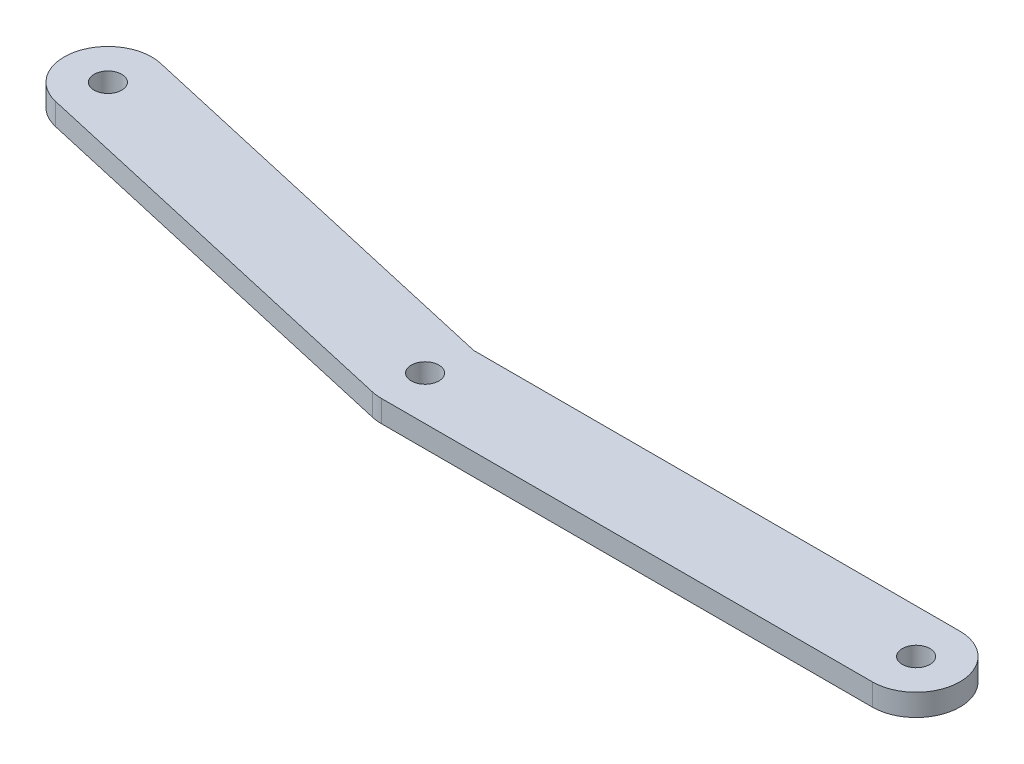
ISO-10303-21;
HEADER;
FILE_DESCRIPTION(('STEP AP214'),'2;1');
FILE_NAME('part.step','',(''),(''),'','','');
FILE_SCHEMA(('AUTOMOTIVE_DESIGN { 1 0 10303 214 1 1 1 1 }'));
ENDSEC;
DATA;
#1=APPLICATION_CONTEXT('core data for automotive mechanical design processes');
#2=APPLICATION_PROTOCOL_DEFINITION('international standard','automotive_design',2000,#1);
#3=PRODUCT_CONTEXT('',#1,'mechanical');
#4=PRODUCT('Part','Part','',(#3));
#5=PRODUCT_RELATED_PRODUCT_CATEGORY('part','',(#4));
#6=PRODUCT_DEFINITION_FORMATION('','',#4);
#7=PRODUCT_DEFINITION_CONTEXT('part definition',#1,'design');
#8=PRODUCT_DEFINITION('design','',#6,#7);
#9=PRODUCT_DEFINITION_SHAPE('','',#8);
#10=(LENGTH_UNIT() NAMED_UNIT(*) SI_UNIT(.MILLI.,.METRE.));
#11=(NAMED_UNIT(*) PLANE_ANGLE_UNIT() SI_UNIT($,.RADIAN.));
#12=(NAMED_UNIT(*) SI_UNIT($,.STERADIAN.) SOLID_ANGLE_UNIT());
#13=UNCERTAINTY_MEASURE_WITH_UNIT(LENGTH_MEASURE(1.E-05),#10,'distance_accuracy_value','');
#14=(GEOMETRIC_REPRESENTATION_CONTEXT(3) GLOBAL_UNCERTAINTY_ASSIGNED_CONTEXT((#13)) GLOBAL_UNIT_ASSIGNED_CONTEXT((#10,
#11,#12)) REPRESENTATION_CONTEXT('',''));
#15=CARTESIAN_POINT('',(0.,0.,0.));
#16=DIRECTION('',(0.,0.,1.));
#17=DIRECTION('',(1.,0.,0.));
#18=AXIS2_PLACEMENT_3D('',#15,#16,#17);
#19=CARTESIAN_POINT('',(-35.56,3.175,0.));
#20=DIRECTION('',(0.,-1.,0.));
#21=DIRECTION('',(0.,0.,-1.));
#22=AXIS2_PLACEMENT_3D('',#19,#20,#21);
#23=CYLINDRICAL_SURFACE('',#22,6.35);
#24=DIRECTION('',(0.,-1.,0.));
#25=VECTOR('',#24,1.);
#26=CARTESIAN_POINT('',(-35.56,3.175,6.35));
#27=LINE('',#26,#25);
#28=CARTESIAN_POINT('',(-35.56,3.175,6.35));
#29=VERTEX_POINT('',#28);
#30=CARTESIAN_POINT('',(-35.56,0.,6.35));
#31=VERTEX_POINT('',#30);
#32=EDGE_CURVE('E54',#29,#31,#27,.T.);
#33=ORIENTED_EDGE('',*,*,#32,.F.);
#34=CARTESIAN_POINT('',(-35.56,3.175,0.));
#35=DIRECTION('',(0.,1.,0.));
#36=DIRECTION('',(0.,0.,1.));
#37=AXIS2_PLACEMENT_3D('',#34,#35,#36);
#38=CIRCLE('',#37,6.35);
#39=CARTESIAN_POINT('',(-36.9668329598836,3.175,6.19219839984034));
#40=VERTEX_POINT('',#39);
#41=EDGE_CURVE('E118',#40,#29,#38,.T.);
#42=ORIENTED_EDGE('',*,*,#41,.F.);
#43=DIRECTION('',(0.,-1.,0.));
#44=VECTOR('',#43,1.);
#45=CARTESIAN_POINT('',(-36.9668329598836,3.175,6.19219839984034));
#46=LINE('',#45,#44);
#47=CARTESIAN_POINT('',(-36.9668329598836,0.,6.19219839984034));
#48=VERTEX_POINT('',#47);
#49=EDGE_CURVE('E143',#40,#48,#46,.T.);
#50=ORIENTED_EDGE('',*,*,#49,.T.);
#51=CARTESIAN_POINT('',(-35.56,0.,0.));
#52=DIRECTION('',(0.,1.,0.));
#53=DIRECTION('',(0.,0.,1.));
#54=AXIS2_PLACEMENT_3D('',#51,#52,#53);
#55=CIRCLE('',#54,6.35);
#56=EDGE_CURVE('E135',#48,#31,#55,.T.);
#57=ORIENTED_EDGE('',*,*,#56,.T.);
#58=EDGE_LOOP('',(#33,#42,#50,#57));
#59=FACE_BOUND('',#58,.T.);
#60=ADVANCED_FACE('F39',(#59),#23,.T.);
#61=CARTESIAN_POINT('',(-0.338584720633398,3.175,1.49028621385869));
#62=DIRECTION('',(-0.221548497619461,0.,0.975149354305565));
#63=DIRECTION('',(0.975149354305565,0.,0.221548497619461));
#64=AXIS2_PLACEMENT_3D('',#61,#62,#63);
#65=PLANE('',#64);
#66=DIRECTION('',(-0.975149354305565,0.,-0.221548497619461));
#67=VECTOR('',#66,1.);
#68=CARTESIAN_POINT('',(-0.338584720633398,3.175,1.49028621385869));
#69=LINE('',#68,#67);
#70=CARTESIAN_POINT('',(-34.8477333773181,3.175,-6.35));
#71=VERTEX_POINT('',#70);
#72=CARTESIAN_POINT('',(-93.5982716785836,3.175,-19.6977948147227));
#73=VERTEX_POINT('',#72);
#74=EDGE_CURVE('E62',#71,#73,#69,.T.);
#75=ORIENTED_EDGE('',*,*,#74,.F.);
#76=DIRECTION('',(0.,-1.,0.));
#77=VECTOR('',#76,1.);
#78=CARTESIAN_POINT('',(-34.8477333773181,3.175,-6.35));
#79=LINE('',#78,#77);
#80=CARTESIAN_POINT('',(-34.8477333773181,0.,-6.35));
#81=VERTEX_POINT('',#80);
#82=EDGE_CURVE('E125',#71,#81,#79,.T.);
#83=ORIENTED_EDGE('',*,*,#82,.T.);
#84=DIRECTION('',(-0.975149354305565,0.,-0.221548497619461));
#85=VECTOR('',#84,1.);
#86=CARTESIAN_POINT('',(-0.338584720633398,0.,1.49028621385869));
#87=LINE('',#86,#85);
#88=CARTESIAN_POINT('',(-93.5982716785836,0.,-19.6977948147227));
#89=VERTEX_POINT('',#88);
#90=EDGE_CURVE('E146',#81,#89,#87,.T.);
#91=ORIENTED_EDGE('',*,*,#90,.T.);
#92=DIRECTION('',(0.,-1.,0.));
#93=VECTOR('',#92,1.);
#94=CARTESIAN_POINT('',(-93.5982716785836,3.175,-19.6977948147227));
#95=LINE('',#94,#93);
#96=EDGE_CURVE('E11',#73,#89,#95,.T.);
#97=ORIENTED_EDGE('',*,*,#96,.F.);
#98=EDGE_LOOP('',(#75,#83,#91,#97));
#99=FACE_BOUND('',#98,.T.);
#100=ADVANCED_FACE('F200',(#99),#65,.F.);
#101=CARTESIAN_POINT('',(-95.0051046384672,3.175,-13.5055964148823));
#102=DIRECTION('',(0.,-1.,0.));
#103=DIRECTION('',(0.,0.,-1.));
#104=AXIS2_PLACEMENT_3D('',#101,#102,#103);
#105=CYLINDRICAL_SURFACE('',#104,6.35);
#106=CARTESIAN_POINT('',(-95.0051046384672,0.,-13.5055964148823));
#107=DIRECTION('',(0.,1.,0.));
#108=DIRECTION('',(0.,0.,1.));
#109=AXIS2_PLACEMENT_3D('',#106,#107,#108);
#110=CIRCLE('',#109,6.35);
#111=CARTESIAN_POINT('',(-96.4119375983508,0.,-7.313398015042));
#112=VERTEX_POINT('',#111);
#113=EDGE_CURVE('E148',#89,#112,#110,.T.);
#114=ORIENTED_EDGE('',*,*,#113,.T.);
#115=DIRECTION('',(0.,-1.,0.));
#116=VECTOR('',#115,1.);
#117=CARTESIAN_POINT('',(-96.4119375983508,3.175,-7.313398015042));
#118=LINE('',#117,#116);
#119=CARTESIAN_POINT('',(-96.4119375983508,3.175,-7.313398015042));
#120=VERTEX_POINT('',#119);
#121=EDGE_CURVE('E47',#120,#112,#118,.T.);
#122=ORIENTED_EDGE('',*,*,#121,.F.);
#123=CARTESIAN_POINT('',(-95.0051046384672,3.175,-13.5055964148823));
#124=DIRECTION('',(0.,1.,0.));
#125=DIRECTION('',(0.,0.,1.));
#126=AXIS2_PLACEMENT_3D('',#123,#124,#125);
#127=CIRCLE('',#126,6.35);
#128=EDGE_CURVE('E137',#73,#120,#127,.T.);
#129=ORIENTED_EDGE('',*,*,#128,.F.);
#130=ORIENTED_EDGE('',*,*,#96,.T.);
#131=EDGE_LOOP('',(#114,#122,#129,#130));
#132=FACE_BOUND('',#131,.T.);
#133=ADVANCED_FACE('F162',(#132),#105,.T.);
#134=CARTESIAN_POINT('',(-3.15225064040056,3.175,13.8746830135394));
#135=DIRECTION('',(-0.221548497619461,0.,0.975149354305565));
#136=DIRECTION('',(0.975149354305565,0.,0.221548497619461));
#137=AXIS2_PLACEMENT_3D('',#134,#135,#136);
#138=PLANE('',#137);
#139=DIRECTION('',(-0.975149354305565,0.,-0.221548497619461));
#140=VECTOR('',#139,1.);
#141=CARTESIAN_POINT('',(-3.15225064040056,0.,13.8746830135394));
#142=LINE('',#141,#140);
#143=EDGE_CURVE('E151',#48,#112,#142,.T.);
#144=ORIENTED_EDGE('',*,*,#143,.F.);
#145=ORIENTED_EDGE('',*,*,#49,.F.);
#146=DIRECTION('',(-0.975149354305565,0.,-0.221548497619461));
#147=VECTOR('',#146,1.);
#148=CARTESIAN_POINT('',(-3.15225064040056,3.175,13.8746830135394));
#149=LINE('',#148,#147);
#150=EDGE_CURVE('E139',#40,#120,#149,.T.);
#151=ORIENTED_EDGE('',*,*,#150,.T.);
#152=ORIENTED_EDGE('',*,*,#121,.T.);
#153=EDGE_LOOP('',(#144,#145,#151,#152));
#154=FACE_BOUND('',#153,.T.);
#155=ADVANCED_FACE('F158',(#154),#138,.T.);
#156=CARTESIAN_POINT('',(-95.0051046384672,3.175,-13.5055964148823));
#157=DIRECTION('',(0.,-1.,0.));
#158=DIRECTION('',(0.,0.,-1.));
#159=AXIS2_PLACEMENT_3D('',#156,#157,#158);
#160=CYLINDRICAL_SURFACE('',#159,2.00000006400001);
#161=CARTESIAN_POINT('',(-95.0051046384672,3.175,-13.5055964148823));
#162=DIRECTION('',(0.,1.,0.));
#163=DIRECTION('',(0.,0.,1.));
#164=AXIS2_PLACEMENT_3D('',#161,#162,#163);
#165=CIRCLE('',#164,2.00000006400001);
#166=CARTESIAN_POINT('',(-95.0051046384672,3.175,-11.5055963508823));
#167=VERTEX_POINT('',#166);
#168=EDGE_CURVE('E132',#167,#167,#165,.T.);
#169=ORIENTED_EDGE('',*,*,#168,.T.);
#170=EDGE_LOOP('',(#169));
#171=FACE_BOUND('',#170,.T.);
#172=CARTESIAN_POINT('',(-95.0051046384672,0.,-13.5055964148823));
#173=DIRECTION('',(0.,1.,0.));
#174=DIRECTION('',(0.,0.,1.));
#175=AXIS2_PLACEMENT_3D('',#172,#173,#174);
#176=CIRCLE('',#175,2.00000006400001);
#177=CARTESIAN_POINT('',(-95.0051046384672,0.,-11.5055963508823));
#178=VERTEX_POINT('',#177);
#179=EDGE_CURVE('E127',#178,#178,#176,.T.);
#180=ORIENTED_EDGE('',*,*,#179,.F.);
#181=EDGE_LOOP('',(#180));
#182=FACE_BOUND('',#181,.T.);
#183=ADVANCED_FACE('F41',(#171,#182),#160,.F.);
#184=CARTESIAN_POINT('',(0.,3.175,0.));
#185=DIRECTION('',(0.,1.,0.));
#186=DIRECTION('',(0.,0.,1.));
#187=AXIS2_PLACEMENT_3D('',#184,#185,#186);
#188=PLANE('',#187);
#189=CARTESIAN_POINT('',(-35.56,3.175,0.));
#190=DIRECTION('',(0.,1.,0.));
#191=DIRECTION('',(0.,0.,1.));
#192=AXIS2_PLACEMENT_3D('',#189,#190,#191);
#193=CIRCLE('',#192,2.000000064);
#194=CARTESIAN_POINT('',(-35.56,3.175,2.000000064));
#195=VERTEX_POINT('',#194);
#196=EDGE_CURVE('E177',#195,#195,#193,.T.);
#197=ORIENTED_EDGE('',*,*,#196,.F.);
#198=EDGE_LOOP('',(#197));
#199=FACE_BOUND('',#198,.T.);
#200=DIRECTION('',(1.,0.,0.));
#201=VECTOR('',#200,1.);
#202=CARTESIAN_POINT('',(0.,3.175,-6.35000000000001));
#203=LINE('',#202,#201);
#204=CARTESIAN_POINT('',(35.56,3.175,-6.35000000000001));
#205=VERTEX_POINT('',#204);
#206=EDGE_CURVE('E111',#71,#205,#203,.T.);
#207=ORIENTED_EDGE('',*,*,#206,.F.);
#208=ORIENTED_EDGE('',*,*,#74,.T.);
#209=ORIENTED_EDGE('',*,*,#128,.T.);
#210=ORIENTED_EDGE('',*,*,#150,.F.);
#211=ORIENTED_EDGE('',*,*,#41,.T.);
#212=DIRECTION('',(1.,0.,0.));
#213=VECTOR('',#212,1.);
#214=CARTESIAN_POINT('',(0.,3.175,6.34999999999999));
#215=LINE('',#214,#213);
#216=CARTESIAN_POINT('',(35.56,3.175,6.34999999999999));
#217=VERTEX_POINT('',#216);
#218=EDGE_CURVE('E112',#29,#217,#215,.T.);
#219=ORIENTED_EDGE('',*,*,#218,.T.);
#220=CARTESIAN_POINT('',(35.56,3.175,0.));
#221=DIRECTION('',(0.,1.,0.));
#222=DIRECTION('',(0.,0.,1.));
#223=AXIS2_PLACEMENT_3D('',#220,#221,#222);
#224=CIRCLE('',#223,6.35);
#225=EDGE_CURVE('E100',#217,#205,#224,.T.);
#226=ORIENTED_EDGE('',*,*,#225,.T.);
#227=EDGE_LOOP('',(#207,#208,#209,#210,#211,#219,#226));
#228=FACE_BOUND('',#227,.T.);
#229=ORIENTED_EDGE('',*,*,#168,.F.);
#230=EDGE_LOOP('',(#229));
#231=FACE_BOUND('',#230,.T.);
#232=CARTESIAN_POINT('',(35.56,3.175,0.));
#233=DIRECTION('',(0.,1.,0.));
#234=DIRECTION('',(0.,0.,1.));
#235=AXIS2_PLACEMENT_3D('',#232,#233,#234);
#236=CIRCLE('',#235,2.000000064);
#237=CARTESIAN_POINT('',(35.56,3.175,2.00000006399999));
#238=VERTEX_POINT('',#237);
#239=EDGE_CURVE('E120',#238,#238,#236,.T.);
#240=ORIENTED_EDGE('',*,*,#239,.F.);
#241=EDGE_LOOP('',(#240));
#242=FACE_BOUND('',#241,.T.);
#243=ADVANCED_FACE('F115',(#199,#228,#231,#242),#188,.T.);
#244=CARTESIAN_POINT('',(0.,0.,0.));
#245=DIRECTION('',(0.,1.,0.));
#246=DIRECTION('',(0.,0.,1.));
#247=AXIS2_PLACEMENT_3D('',#244,#245,#246);
#248=PLANE('',#247);
#249=CARTESIAN_POINT('',(-35.56,0.,0.));
#250=DIRECTION('',(0.,1.,0.));
#251=DIRECTION('',(0.,0.,1.));
#252=AXIS2_PLACEMENT_3D('',#249,#250,#251);
#253=CIRCLE('',#252,2.000000064);
#254=CARTESIAN_POINT('',(-35.56,0.,2.000000064));
#255=VERTEX_POINT('',#254);
#256=EDGE_CURVE('E183',#255,#255,#253,.T.);
#257=ORIENTED_EDGE('',*,*,#256,.T.);
#258=EDGE_LOOP('',(#257));
#259=FACE_BOUND('',#258,.T.);
#260=ORIENTED_EDGE('',*,*,#90,.F.);
#261=DIRECTION('',(1.,0.,0.));
#262=VECTOR('',#261,1.);
#263=CARTESIAN_POINT('',(0.,0.,-6.35000000000001));
#264=LINE('',#263,#262);
#265=CARTESIAN_POINT('',(35.56,0.,-6.35000000000001));
#266=VERTEX_POINT('',#265);
#267=EDGE_CURVE('E170',#81,#266,#264,.T.);
#268=ORIENTED_EDGE('',*,*,#267,.T.);
#269=CARTESIAN_POINT('',(35.56,0.,0.));
#270=DIRECTION('',(0.,1.,0.));
#271=DIRECTION('',(0.,0.,1.));
#272=AXIS2_PLACEMENT_3D('',#269,#270,#271);
#273=CIRCLE('',#272,6.35);
#274=CARTESIAN_POINT('',(35.56,0.,6.34999999999999));
#275=VERTEX_POINT('',#274);
#276=EDGE_CURVE('E172',#275,#266,#273,.T.);
#277=ORIENTED_EDGE('',*,*,#276,.F.);
#278=DIRECTION('',(1.,0.,0.));
#279=VECTOR('',#278,1.);
#280=CARTESIAN_POINT('',(0.,0.,6.34999999999999));
#281=LINE('',#280,#279);
#282=EDGE_CURVE('E124',#31,#275,#281,.T.);
#283=ORIENTED_EDGE('',*,*,#282,.F.);
#284=ORIENTED_EDGE('',*,*,#56,.F.);
#285=ORIENTED_EDGE('',*,*,#143,.T.);
#286=ORIENTED_EDGE('',*,*,#113,.F.);
#287=EDGE_LOOP('',(#260,#268,#277,#283,#284,#285,#286));
#288=FACE_BOUND('',#287,.T.);
#289=ORIENTED_EDGE('',*,*,#179,.T.);
#290=EDGE_LOOP('',(#289));
#291=FACE_BOUND('',#290,.T.);
#292=CARTESIAN_POINT('',(35.56,0.,0.));
#293=DIRECTION('',(0.,1.,0.));
#294=DIRECTION('',(0.,0.,1.));
#295=AXIS2_PLACEMENT_3D('',#292,#293,#294);
#296=CIRCLE('',#295,2.000000064);
#297=CARTESIAN_POINT('',(35.56,0.,2.00000006399999));
#298=VERTEX_POINT('',#297);
#299=EDGE_CURVE('E175',#298,#298,#296,.T.);
#300=ORIENTED_EDGE('',*,*,#299,.T.);
#301=EDGE_LOOP('',(#300));
#302=FACE_BOUND('',#301,.T.);
#303=ADVANCED_FACE('F166',(#259,#288,#291,#302),#248,.F.);
#304=CARTESIAN_POINT('',(0.,3.175,-6.35000000000001));
#305=DIRECTION('',(0.,0.,-1.));
#306=DIRECTION('',(-1.,0.,0.));
#307=AXIS2_PLACEMENT_3D('',#304,#305,#306);
#308=PLANE('',#307);
#309=ORIENTED_EDGE('',*,*,#82,.F.);
#310=ORIENTED_EDGE('',*,*,#206,.T.);
#311=DIRECTION('',(0.,-1.,0.));
#312=VECTOR('',#311,1.);
#313=CARTESIAN_POINT('',(35.56,3.175,-6.35000000000001));
#314=LINE('',#313,#312);
#315=EDGE_CURVE('E108',#205,#266,#314,.T.);
#316=ORIENTED_EDGE('',*,*,#315,.T.);
#317=ORIENTED_EDGE('',*,*,#267,.F.);
#318=EDGE_LOOP('',(#309,#310,#316,#317));
#319=FACE_BOUND('',#318,.T.);
#320=ADVANCED_FACE('F238',(#319),#308,.T.);
#321=CARTESIAN_POINT('',(0.,3.175,6.34999999999999));
#322=DIRECTION('',(0.,0.,-1.));
#323=DIRECTION('',(-1.,0.,0.));
#324=AXIS2_PLACEMENT_3D('',#321,#322,#323);
#325=PLANE('',#324);
#326=ORIENTED_EDGE('',*,*,#282,.T.);
#327=DIRECTION('',(0.,-1.,0.));
#328=VECTOR('',#327,1.);
#329=CARTESIAN_POINT('',(35.56,3.175,6.34999999999999));
#330=LINE('',#329,#328);
#331=EDGE_CURVE('E105',#217,#275,#330,.T.);
#332=ORIENTED_EDGE('',*,*,#331,.F.);
#333=ORIENTED_EDGE('',*,*,#218,.F.);
#334=ORIENTED_EDGE('',*,*,#32,.T.);
#335=EDGE_LOOP('',(#326,#332,#333,#334));
#336=FACE_BOUND('',#335,.T.);
#337=ADVANCED_FACE('F122',(#336),#325,.F.);
#338=CARTESIAN_POINT('',(35.56,3.175,0.));
#339=DIRECTION('',(0.,-1.,0.));
#340=DIRECTION('',(0.,0.,-1.));
#341=AXIS2_PLACEMENT_3D('',#338,#339,#340);
#342=CYLINDRICAL_SURFACE('',#341,6.35);
#343=ORIENTED_EDGE('',*,*,#276,.T.);
#344=ORIENTED_EDGE('',*,*,#315,.F.);
#345=ORIENTED_EDGE('',*,*,#225,.F.);
#346=ORIENTED_EDGE('',*,*,#331,.T.);
#347=EDGE_LOOP('',(#343,#344,#345,#346));
#348=FACE_BOUND('',#347,.T.);
#349=ADVANCED_FACE('F103',(#348),#342,.T.);
#350=CARTESIAN_POINT('',(35.56,3.175,0.));
#351=DIRECTION('',(0.,-1.,0.));
#352=DIRECTION('',(0.,0.,-1.));
#353=AXIS2_PLACEMENT_3D('',#350,#351,#352);
#354=CYLINDRICAL_SURFACE('',#353,2.000000064);
#355=ORIENTED_EDGE('',*,*,#239,.T.);
#356=EDGE_LOOP('',(#355));
#357=FACE_BOUND('',#356,.T.);
#358=ORIENTED_EDGE('',*,*,#299,.F.);
#359=EDGE_LOOP('',(#358));
#360=FACE_BOUND('',#359,.T.);
#361=ADVANCED_FACE('F190',(#357,#360),#354,.F.);
#362=CARTESIAN_POINT('',(-35.56,0.,0.));
#363=DIRECTION('',(0.,1.,0.));
#364=DIRECTION('',(0.,0.,1.));
#365=AXIS2_PLACEMENT_3D('',#362,#363,#364);
#366=CYLINDRICAL_SURFACE('',#365,2.000000064);
#367=ORIENTED_EDGE('',*,*,#196,.T.);
#368=EDGE_LOOP('',(#367));
#369=FACE_BOUND('',#368,.T.);
#370=ORIENTED_EDGE('',*,*,#256,.F.);
#371=EDGE_LOOP('',(#370));
#372=FACE_BOUND('',#371,.T.);
#373=ADVANCED_FACE('F188',(#369,#372),#366,.F.);
#374=CLOSED_SHELL('',(#60,#100,#133,#155,#183,#243,#303,#320,#337,#349,#361,#373));
#375=MANIFOLD_SOLID_BREP('B2',#374);
#376=ADVANCED_BREP_SHAPE_REPRESENTATION('',(#18,#375),#14);
#377=SHAPE_DEFINITION_REPRESENTATION(#9,#376);
ENDSEC;
END-ISO-10303-21;
